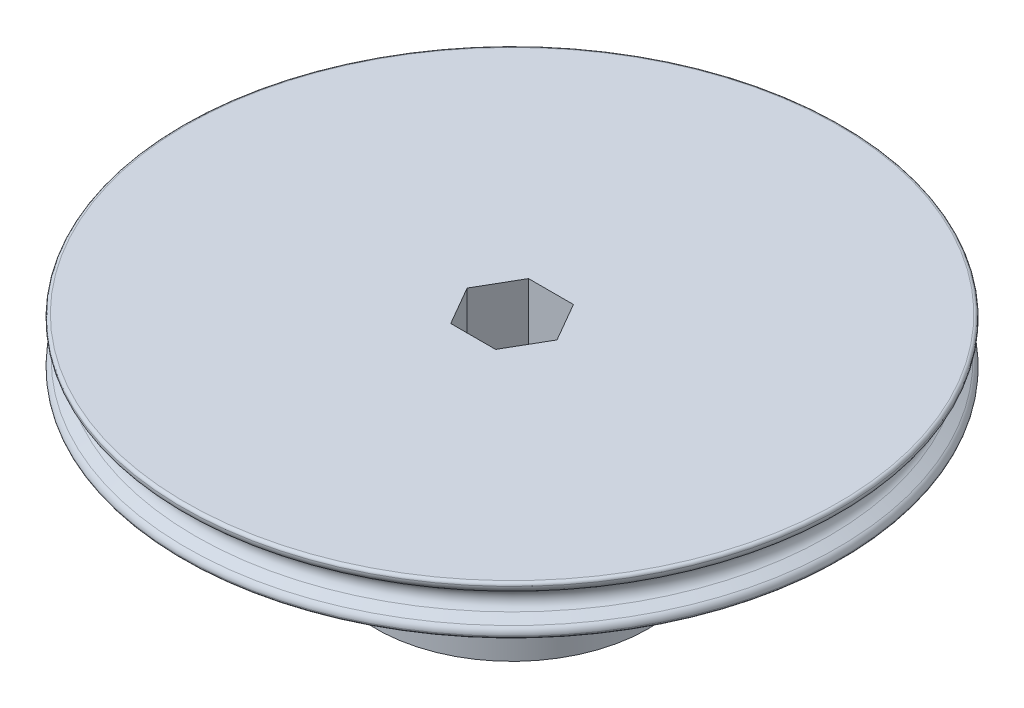
ISO-10303-21;
HEADER;
FILE_DESCRIPTION(('STEP AP214'),'2;1');
FILE_NAME('part.step','',(''),(''),'','','');
FILE_SCHEMA(('AUTOMOTIVE_DESIGN { 1 0 10303 214 1 1 1 1 }'));
ENDSEC;
DATA;
#1=APPLICATION_CONTEXT('core data for automotive mechanical design processes');
#2=APPLICATION_PROTOCOL_DEFINITION('international standard','automotive_design',2000,#1);
#3=PRODUCT_CONTEXT('',#1,'mechanical');
#4=PRODUCT('Part','Part','',(#3));
#5=PRODUCT_RELATED_PRODUCT_CATEGORY('part','',(#4));
#6=PRODUCT_DEFINITION_FORMATION('','',#4);
#7=PRODUCT_DEFINITION_CONTEXT('part definition',#1,'design');
#8=PRODUCT_DEFINITION('design','',#6,#7);
#9=PRODUCT_DEFINITION_SHAPE('','',#8);
#10=(LENGTH_UNIT() NAMED_UNIT(*) SI_UNIT(.MILLI.,.METRE.));
#11=(NAMED_UNIT(*) PLANE_ANGLE_UNIT() SI_UNIT($,.RADIAN.));
#12=(NAMED_UNIT(*) SI_UNIT($,.STERADIAN.) SOLID_ANGLE_UNIT());
#13=UNCERTAINTY_MEASURE_WITH_UNIT(LENGTH_MEASURE(1.E-05),#10,'distance_accuracy_value','');
#14=(GEOMETRIC_REPRESENTATION_CONTEXT(3) GLOBAL_UNCERTAINTY_ASSIGNED_CONTEXT((#13)) GLOBAL_UNIT_ASSIGNED_CONTEXT((#10,
#11,#12)) REPRESENTATION_CONTEXT('',''));
#15=CARTESIAN_POINT('',(0.,0.,0.));
#16=DIRECTION('',(0.,0.,1.));
#17=DIRECTION('',(1.,0.,0.));
#18=AXIS2_PLACEMENT_3D('',#15,#16,#17);
#19=CARTESIAN_POINT('',(0.,-4.00000469999999,0.));
#20=DIRECTION('',(0.,-1.,0.));
#21=DIRECTION('',(1.,0.,0.));
#22=AXIS2_PLACEMENT_3D('',#19,#20,#21);
#23=PLANE('',#22);
#24=CARTESIAN_POINT('',(0.,-4.00000469999999,0.));
#25=DIRECTION('',(0.,1.,0.));
#26=DIRECTION('',(-1.,0.,0.));
#27=AXIS2_PLACEMENT_3D('',#24,#25,#26);
#28=CIRCLE('',#27,53.3006219074877);
#29=CARTESIAN_POINT('',(-53.3006219074877,-4.0000047,0.));
#30=VERTEX_POINT('',#29);
#31=EDGE_CURVE('E149',#30,#30,#28,.T.);
#32=ORIENTED_EDGE('',*,*,#31,.F.);
#33=EDGE_LOOP('',(#32));
#34=FACE_BOUND('',#33,.T.);
#35=CARTESIAN_POINT('',(0.,-4.00000469999999,0.));
#36=DIRECTION('',(0.,-1.,0.));
#37=DIRECTION('',(1.,0.,0.));
#38=AXIS2_PLACEMENT_3D('',#35,#36,#37);
#39=CIRCLE('',#38,22.225);
#40=CARTESIAN_POINT('',(22.225,-4.00000469999999,0.));
#41=VERTEX_POINT('',#40);
#42=EDGE_CURVE('E119',#41,#41,#39,.T.);
#43=ORIENTED_EDGE('',*,*,#42,.F.);
#44=EDGE_LOOP('',(#43));
#45=FACE_BOUND('',#44,.T.);
#46=ADVANCED_FACE('F33',(#34,#45),#23,.T.);
#47=CARTESIAN_POINT('',(0.,3.50000570000001,0.));
#48=DIRECTION('',(0.,1.,0.));
#49=DIRECTION('',(-1.,0.,0.));
#50=AXIS2_PLACEMENT_3D('',#47,#48,#49);
#51=TOROIDAL_SURFACE('',#50,53.3006219074877,0.499999);
#52=CARTESIAN_POINT('',(0.,3.52503594612088,0.));
#53=DIRECTION('',(0.,1.,0.));
#54=DIRECTION('',(-1.,0.,0.));
#55=AXIS2_PLACEMENT_3D('',#52,#53,#54);
#56=CIRCLE('',#55,53.799994);
#57=CARTESIAN_POINT('',(-53.799994,3.52503594612087,0.));
#58=VERTEX_POINT('',#57);
#59=EDGE_CURVE('E11',#58,#58,#56,.T.);
#60=ORIENTED_EDGE('',*,*,#59,.T.);
#61=EDGE_LOOP('',(#60));
#62=FACE_BOUND('',#61,.T.);
#63=CARTESIAN_POINT('',(0.,4.00000470000001,0.));
#64=DIRECTION('',(0.,1.,0.));
#65=DIRECTION('',(-1.,0.,0.));
#66=AXIS2_PLACEMENT_3D('',#63,#64,#65);
#67=CIRCLE('',#66,53.3006219074877);
#68=CARTESIAN_POINT('',(-53.3006219074877,4.0000047,0.));
#69=VERTEX_POINT('',#68);
#70=EDGE_CURVE('E141',#69,#69,#67,.T.);
#71=ORIENTED_EDGE('',*,*,#70,.F.);
#72=EDGE_LOOP('',(#71));
#73=FACE_BOUND('',#72,.T.);
#74=ADVANCED_FACE('F35',(#62,#73),#51,.T.);
#75=CARTESIAN_POINT('',(0.,3.46496335543079,0.));
#76=DIRECTION('',(0.,1.,0.));
#77=DIRECTION('',(-1.,0.,0.));
#78=AXIS2_PLACEMENT_3D('',#75,#76,#77);
#79=TOROIDAL_SURFACE('',#78,52.6015009779704,1.1999976);
#80=CARTESIAN_POINT('',(0.,2.42573494935043,0.));
#81=DIRECTION('',(0.,1.,0.));
#82=DIRECTION('',(-1.,0.,0.));
#83=AXIS2_PLACEMENT_3D('',#80,#81,#82);
#84=CIRCLE('',#83,53.2014997779704);
#85=CARTESIAN_POINT('',(-53.2014997779704,2.42573494935042,0.));
#86=VERTEX_POINT('',#85);
#87=EDGE_CURVE('E41',#86,#86,#84,.T.);
#88=ORIENTED_EDGE('',*,*,#87,.T.);
#89=EDGE_LOOP('',(#88));
#90=FACE_BOUND('',#89,.T.);
#91=ORIENTED_EDGE('',*,*,#59,.F.);
#92=EDGE_LOOP('',(#91));
#93=FACE_BOUND('',#92,.T.);
#94=ADVANCED_FACE('F166',(#90,#93),#79,.T.);
#95=CARTESIAN_POINT('',(0.,2.42573494935043,0.));
#96=DIRECTION('',(0.,1.,0.));
#97=DIRECTION('',(-1.,0.,0.));
#98=AXIS2_PLACEMENT_3D('',#95,#96,#97);
#99=CONICAL_SURFACE('',#98,53.2014997779704,1.0471975511966);
#100=CARTESIAN_POINT('',(0.,1.55884260912055,0.));
#101=DIRECTION('',(0.,1.,0.));
#102=DIRECTION('',(-1.,0.,0.));
#103=AXIS2_PLACEMENT_3D('',#100,#101,#102);
#104=CIRCLE('',#103,51.6999982);
#105=CARTESIAN_POINT('',(-51.6999982,1.55884260912054,0.));
#106=VERTEX_POINT('',#105);
#107=EDGE_CURVE('E161',#106,#106,#104,.T.);
#108=ORIENTED_EDGE('',*,*,#107,.T.);
#109=EDGE_LOOP('',(#108));
#110=FACE_BOUND('',#109,.T.);
#111=ORIENTED_EDGE('',*,*,#87,.F.);
#112=EDGE_LOOP('',(#111));
#113=FACE_BOUND('',#112,.T.);
#114=ADVANCED_FACE('F169',(#110,#113),#99,.T.);
#115=CARTESIAN_POINT('',(0.,0.,0.));
#116=DIRECTION('',(0.,1.,0.));
#117=DIRECTION('',(-1.,0.,0.));
#118=AXIS2_PLACEMENT_3D('',#115,#116,#117);
#119=TOROIDAL_SURFACE('',#118,52.5999964,1.7999964);
#120=CARTESIAN_POINT('',(0.,-1.55884260912053,0.));
#121=DIRECTION('',(0.,1.,0.));
#122=DIRECTION('',(-1.,0.,0.));
#123=AXIS2_PLACEMENT_3D('',#120,#121,#122);
#124=CIRCLE('',#123,51.6999982);
#125=CARTESIAN_POINT('',(-51.6999982,-1.55884260912054,0.));
#126=VERTEX_POINT('',#125);
#127=EDGE_CURVE('E158',#126,#126,#124,.T.);
#128=ORIENTED_EDGE('',*,*,#127,.T.);
#129=EDGE_LOOP('',(#128));
#130=FACE_BOUND('',#129,.T.);
#131=ORIENTED_EDGE('',*,*,#107,.F.);
#132=EDGE_LOOP('',(#131));
#133=FACE_BOUND('',#132,.T.);
#134=ADVANCED_FACE('F171',(#130,#133),#119,.F.);
#135=CARTESIAN_POINT('',(0.,-1.55884260912053,0.));
#136=DIRECTION('',(0.,-1.,0.));
#137=DIRECTION('',(1.,0.,0.));
#138=AXIS2_PLACEMENT_3D('',#135,#136,#137);
#139=CONICAL_SURFACE('',#138,51.6999982,1.0471975511966);
#140=CARTESIAN_POINT('',(0.,-2.42573494935041,0.));
#141=DIRECTION('',(0.,1.,0.));
#142=DIRECTION('',(-1.,0.,0.));
#143=AXIS2_PLACEMENT_3D('',#140,#141,#142);
#144=CIRCLE('',#143,53.2014997779704);
#145=CARTESIAN_POINT('',(-53.2014997779704,-2.42573494935042,0.));
#146=VERTEX_POINT('',#145);
#147=EDGE_CURVE('E155',#146,#146,#144,.T.);
#148=ORIENTED_EDGE('',*,*,#147,.T.);
#149=EDGE_LOOP('',(#148));
#150=FACE_BOUND('',#149,.T.);
#151=ORIENTED_EDGE('',*,*,#127,.F.);
#152=EDGE_LOOP('',(#151));
#153=FACE_BOUND('',#152,.T.);
#154=ADVANCED_FACE('F178',(#150,#153),#139,.T.);
#155=CARTESIAN_POINT('',(0.,-3.46496335543077,0.));
#156=DIRECTION('',(0.,1.,0.));
#157=DIRECTION('',(-1.,0.,0.));
#158=AXIS2_PLACEMENT_3D('',#155,#156,#157);
#159=TOROIDAL_SURFACE('',#158,52.6015009779704,1.1999976);
#160=CARTESIAN_POINT('',(0.,-3.52503594612086,0.));
#161=DIRECTION('',(0.,1.,0.));
#162=DIRECTION('',(-1.,0.,0.));
#163=AXIS2_PLACEMENT_3D('',#160,#161,#162);
#164=CIRCLE('',#163,53.799994);
#165=CARTESIAN_POINT('',(-53.799994,-3.52503594612087,0.));
#166=VERTEX_POINT('',#165);
#167=EDGE_CURVE('E152',#166,#166,#164,.T.);
#168=ORIENTED_EDGE('',*,*,#167,.T.);
#169=EDGE_LOOP('',(#168));
#170=FACE_BOUND('',#169,.T.);
#171=ORIENTED_EDGE('',*,*,#147,.F.);
#172=EDGE_LOOP('',(#171));
#173=FACE_BOUND('',#172,.T.);
#174=ADVANCED_FACE('F199',(#170,#173),#159,.T.);
#175=CARTESIAN_POINT('',(0.,-3.50000569999999,0.));
#176=DIRECTION('',(0.,1.,0.));
#177=DIRECTION('',(-1.,0.,0.));
#178=AXIS2_PLACEMENT_3D('',#175,#176,#177);
#179=TOROIDAL_SURFACE('',#178,53.3006219074877,0.499999);
#180=ORIENTED_EDGE('',*,*,#31,.T.);
#181=EDGE_LOOP('',(#180));
#182=FACE_BOUND('',#181,.T.);
#183=ORIENTED_EDGE('',*,*,#167,.F.);
#184=EDGE_LOOP('',(#183));
#185=FACE_BOUND('',#184,.T.);
#186=ADVANCED_FACE('F196',(#182,#185),#179,.T.);
#187=CARTESIAN_POINT('',(0.,4.00000470000001,0.));
#188=DIRECTION('',(0.,1.,0.));
#189=DIRECTION('',(-1.,0.,0.));
#190=AXIS2_PLACEMENT_3D('',#187,#188,#189);
#191=PLANE('',#190);
#192=DIRECTION('',(0.5,0.,0.866025403784439));
#193=VECTOR('',#192,1.);
#194=CARTESIAN_POINT('',(3.66617420935412,4.00000470000001,-6.35000000000001));
#195=LINE('',#194,#193);
#196=CARTESIAN_POINT('',(3.66617420935412,4.00000470000001,-6.35000000000001));
#197=VERTEX_POINT('',#196);
#198=CARTESIAN_POINT('',(7.33234841870825,4.00000470000002,0.));
#199=VERTEX_POINT('',#198);
#200=EDGE_CURVE('E123',#197,#199,#195,.T.);
#201=ORIENTED_EDGE('',*,*,#200,.T.);
#202=DIRECTION('',(-0.5,0.,0.866025403784439));
#203=VECTOR('',#202,1.);
#204=CARTESIAN_POINT('',(7.33234841870825,4.00000470000002,0.));
#205=LINE('',#204,#203);
#206=CARTESIAN_POINT('',(3.66617420935412,4.00000470000001,6.35));
#207=VERTEX_POINT('',#206);
#208=EDGE_CURVE('E128',#199,#207,#205,.T.);
#209=ORIENTED_EDGE('',*,*,#208,.T.);
#210=DIRECTION('',(-1.,0.,0.));
#211=VECTOR('',#210,1.);
#212=CARTESIAN_POINT('',(3.66617420935412,4.00000470000001,6.35));
#213=LINE('',#212,#211);
#214=CARTESIAN_POINT('',(-3.66617420935412,4.00000470000001,6.35));
#215=VERTEX_POINT('',#214);
#216=EDGE_CURVE('E48',#207,#215,#213,.T.);
#217=ORIENTED_EDGE('',*,*,#216,.T.);
#218=DIRECTION('',(-0.5,0.,-0.866025403784438));
#219=VECTOR('',#218,1.);
#220=CARTESIAN_POINT('',(-3.66617420935412,4.00000470000001,6.35));
#221=LINE('',#220,#219);
#222=CARTESIAN_POINT('',(-7.33234841870825,4.00000470000001,0.));
#223=VERTEX_POINT('',#222);
#224=EDGE_CURVE('E94',#215,#223,#221,.T.);
#225=ORIENTED_EDGE('',*,*,#224,.T.);
#226=DIRECTION('',(0.5,0.,-0.866025403784439));
#227=VECTOR('',#226,1.);
#228=CARTESIAN_POINT('',(-7.33234841870825,4.00000470000001,0.));
#229=LINE('',#228,#227);
#230=CARTESIAN_POINT('',(-3.66617420935413,4.00000470000001,-6.35));
#231=VERTEX_POINT('',#230);
#232=EDGE_CURVE('E133',#223,#231,#229,.T.);
#233=ORIENTED_EDGE('',*,*,#232,.T.);
#234=DIRECTION('',(1.,0.,0.));
#235=VECTOR('',#234,1.);
#236=CARTESIAN_POINT('',(-3.66617420935413,4.00000470000001,-6.35));
#237=LINE('',#236,#235);
#238=EDGE_CURVE('E136',#231,#197,#237,.T.);
#239=ORIENTED_EDGE('',*,*,#238,.T.);
#240=EDGE_LOOP('',(#201,#209,#217,#225,#233,#239));
#241=FACE_BOUND('',#240,.T.);
#242=ORIENTED_EDGE('',*,*,#70,.T.);
#243=EDGE_LOOP('',(#242));
#244=FACE_BOUND('',#243,.T.);
#245=ADVANCED_FACE('F194',(#241,#244),#191,.T.);
#246=CARTESIAN_POINT('',(3.66617420935412,4.00000470000001,-6.35000000000001));
#247=DIRECTION('',(0.866025403784439,0.,-0.5));
#248=DIRECTION('',(-0.5,0.,-0.866025403784439));
#249=AXIS2_PLACEMENT_3D('',#246,#247,#248);
#250=PLANE('',#249);
#251=DIRECTION('',(0.,-1.,0.));
#252=VECTOR('',#251,1.);
#253=CARTESIAN_POINT('',(3.66617420935412,4.00000470000001,-6.35000000000001));
#254=LINE('',#253,#252);
#255=CARTESIAN_POINT('',(3.66617420935417,-29.4000047,-6.34999999999998));
#256=VERTEX_POINT('',#255);
#257=EDGE_CURVE('E56',#197,#256,#254,.T.);
#258=ORIENTED_EDGE('',*,*,#257,.T.);
#259=DIRECTION('',(0.499999999999993,0.,0.866025403784442));
#260=VECTOR('',#259,1.);
#261=CARTESIAN_POINT('',(3.66617420935417,-29.4000047,-6.34999999999998));
#262=LINE('',#261,#260);
#263=CARTESIAN_POINT('',(7.33234841870826,-29.4000047,0.));
#264=VERTEX_POINT('',#263);
#265=EDGE_CURVE('E114',#256,#264,#262,.T.);
#266=ORIENTED_EDGE('',*,*,#265,.T.);
#267=DIRECTION('',(0.,-1.,0.));
#268=VECTOR('',#267,1.);
#269=CARTESIAN_POINT('',(7.33234841870825,4.00000470000002,0.));
#270=LINE('',#269,#268);
#271=EDGE_CURVE('E139',#199,#264,#270,.T.);
#272=ORIENTED_EDGE('',*,*,#271,.F.);
#273=ORIENTED_EDGE('',*,*,#200,.F.);
#274=EDGE_LOOP('',(#258,#266,#272,#273));
#275=FACE_BOUND('',#274,.T.);
#276=ADVANCED_FACE('F229',(#275),#250,.F.);
#277=CARTESIAN_POINT('',(-3.66617420935413,4.00000470000001,-6.35));
#278=DIRECTION('',(0.,0.,-1.));
#279=DIRECTION('',(-1.,0.,0.));
#280=AXIS2_PLACEMENT_3D('',#277,#278,#279);
#281=PLANE('',#280);
#282=DIRECTION('',(0.,-1.,0.));
#283=VECTOR('',#282,1.);
#284=CARTESIAN_POINT('',(-3.66617420935413,4.00000470000001,-6.35));
#285=LINE('',#284,#283);
#286=CARTESIAN_POINT('',(-3.66617420935409,-29.4000047,-6.35000000000002));
#287=VERTEX_POINT('',#286);
#288=EDGE_CURVE('E142',#231,#287,#285,.T.);
#289=ORIENTED_EDGE('',*,*,#288,.T.);
#290=DIRECTION('',(1.,0.,0.));
#291=VECTOR('',#290,1.);
#292=CARTESIAN_POINT('',(-3.66617420935409,-29.4000047,-6.35000000000002));
#293=LINE('',#292,#291);
#294=EDGE_CURVE('E110',#287,#256,#293,.T.);
#295=ORIENTED_EDGE('',*,*,#294,.T.);
#296=ORIENTED_EDGE('',*,*,#257,.F.);
#297=ORIENTED_EDGE('',*,*,#238,.F.);
#298=EDGE_LOOP('',(#289,#295,#296,#297));
#299=FACE_BOUND('',#298,.T.);
#300=ADVANCED_FACE('F241',(#299),#281,.F.);
#301=CARTESIAN_POINT('',(-7.33234841870825,4.00000470000001,0.));
#302=DIRECTION('',(-0.866025403784439,0.,-0.5));
#303=DIRECTION('',(-0.5,0.,0.866025403784439));
#304=AXIS2_PLACEMENT_3D('',#301,#302,#303);
#305=PLANE('',#304);
#306=DIRECTION('',(0.,-1.,0.));
#307=VECTOR('',#306,1.);
#308=CARTESIAN_POINT('',(-7.33234841870825,4.00000470000001,0.));
#309=LINE('',#308,#307);
#310=CARTESIAN_POINT('',(-7.33234841870824,-29.4000047,0.));
#311=VERTEX_POINT('',#310);
#312=EDGE_CURVE('E95',#223,#311,#309,.T.);
#313=ORIENTED_EDGE('',*,*,#312,.T.);
#314=DIRECTION('',(0.500000000000003,0.,-0.866025403784437));
#315=VECTOR('',#314,1.);
#316=CARTESIAN_POINT('',(-7.33234841870824,-29.4000047,0.));
#317=LINE('',#316,#315);
#318=EDGE_CURVE('E108',#311,#287,#317,.T.);
#319=ORIENTED_EDGE('',*,*,#318,.T.);
#320=ORIENTED_EDGE('',*,*,#288,.F.);
#321=ORIENTED_EDGE('',*,*,#232,.F.);
#322=EDGE_LOOP('',(#313,#319,#320,#321));
#323=FACE_BOUND('',#322,.T.);
#324=ADVANCED_FACE('F247',(#323),#305,.F.);
#325=CARTESIAN_POINT('',(-3.66617420935412,4.00000470000001,6.35));
#326=DIRECTION('',(-0.866025403784438,0.,0.5));
#327=DIRECTION('',(0.5,0.,0.866025403784439));
#328=AXIS2_PLACEMENT_3D('',#325,#326,#327);
#329=PLANE('',#328);
#330=DIRECTION('',(0.,-1.,0.));
#331=VECTOR('',#330,1.);
#332=CARTESIAN_POINT('',(-3.66617420935412,4.00000470000001,6.35));
#333=LINE('',#332,#331);
#334=CARTESIAN_POINT('',(-3.66617420935412,-29.4000047,6.35));
#335=VERTEX_POINT('',#334);
#336=EDGE_CURVE('E87',#215,#335,#333,.T.);
#337=ORIENTED_EDGE('',*,*,#336,.T.);
#338=DIRECTION('',(-0.499999999999999,0.,-0.866025403784439));
#339=VECTOR('',#338,1.);
#340=CARTESIAN_POINT('',(-3.66617420935412,-29.4000047,6.35));
#341=LINE('',#340,#339);
#342=EDGE_CURVE('E91',#335,#311,#341,.T.);
#343=ORIENTED_EDGE('',*,*,#342,.T.);
#344=ORIENTED_EDGE('',*,*,#312,.F.);
#345=ORIENTED_EDGE('',*,*,#224,.F.);
#346=EDGE_LOOP('',(#337,#343,#344,#345));
#347=FACE_BOUND('',#346,.T.);
#348=ADVANCED_FACE('F89',(#347),#329,.F.);
#349=CARTESIAN_POINT('',(3.66617420935412,4.00000470000001,6.35));
#350=DIRECTION('',(0.,0.,1.));
#351=DIRECTION('',(1.,0.,0.));
#352=AXIS2_PLACEMENT_3D('',#349,#350,#351);
#353=PLANE('',#352);
#354=DIRECTION('',(0.,-1.,0.));
#355=VECTOR('',#354,1.);
#356=CARTESIAN_POINT('',(3.66617420935412,4.00000470000001,6.35));
#357=LINE('',#356,#355);
#358=CARTESIAN_POINT('',(3.66617420935406,-29.4000047,6.35000000000004));
#359=VERTEX_POINT('',#358);
#360=EDGE_CURVE('E96',#207,#359,#357,.T.);
#361=ORIENTED_EDGE('',*,*,#360,.T.);
#362=DIRECTION('',(-1.,0.,0.));
#363=VECTOR('',#362,1.);
#364=CARTESIAN_POINT('',(3.66617420935406,-29.4000047,6.35000000000004));
#365=LINE('',#364,#363);
#366=EDGE_CURVE('E99',#359,#335,#365,.T.);
#367=ORIENTED_EDGE('',*,*,#366,.T.);
#368=ORIENTED_EDGE('',*,*,#336,.F.);
#369=ORIENTED_EDGE('',*,*,#216,.F.);
#370=EDGE_LOOP('',(#361,#367,#368,#369));
#371=FACE_BOUND('',#370,.T.);
#372=ADVANCED_FACE('F100',(#371),#353,.F.);
#373=CARTESIAN_POINT('',(7.33234841870825,4.00000470000002,0.));
#374=DIRECTION('',(0.866025403784439,0.,0.5));
#375=DIRECTION('',(0.5,0.,-0.866025403784439));
#376=AXIS2_PLACEMENT_3D('',#373,#374,#375);
#377=PLANE('',#376);
#378=ORIENTED_EDGE('',*,*,#271,.T.);
#379=DIRECTION('',(-0.500000000000009,0.,0.866025403784433));
#380=VECTOR('',#379,1.);
#381=CARTESIAN_POINT('',(7.33234841870825,-29.4000047,0.));
#382=LINE('',#381,#380);
#383=EDGE_CURVE('E117',#264,#359,#382,.T.);
#384=ORIENTED_EDGE('',*,*,#383,.T.);
#385=ORIENTED_EDGE('',*,*,#360,.F.);
#386=ORIENTED_EDGE('',*,*,#208,.F.);
#387=EDGE_LOOP('',(#378,#384,#385,#386));
#388=FACE_BOUND('',#387,.T.);
#389=ADVANCED_FACE('F267',(#388),#377,.F.);
#390=CARTESIAN_POINT('',(0.,-29.4000047,0.));
#391=DIRECTION('',(0.,-1.,0.));
#392=DIRECTION('',(1.,0.,0.));
#393=AXIS2_PLACEMENT_3D('',#390,#391,#392);
#394=PLANE('',#393);
#395=CARTESIAN_POINT('',(0.,-29.4000047,0.));
#396=DIRECTION('',(0.,-1.,0.));
#397=DIRECTION('',(1.,0.,0.));
#398=AXIS2_PLACEMENT_3D('',#395,#396,#397);
#399=CIRCLE('',#398,22.225);
#400=CARTESIAN_POINT('',(22.225,-29.4000047,0.));
#401=VERTEX_POINT('',#400);
#402=EDGE_CURVE('E120',#401,#401,#399,.T.);
#403=ORIENTED_EDGE('',*,*,#402,.T.);
#404=EDGE_LOOP('',(#403));
#405=FACE_BOUND('',#404,.T.);
#406=ORIENTED_EDGE('',*,*,#342,.F.);
#407=ORIENTED_EDGE('',*,*,#366,.F.);
#408=ORIENTED_EDGE('',*,*,#383,.F.);
#409=ORIENTED_EDGE('',*,*,#265,.F.);
#410=ORIENTED_EDGE('',*,*,#294,.F.);
#411=ORIENTED_EDGE('',*,*,#318,.F.);
#412=EDGE_LOOP('',(#406,#407,#408,#409,#410,#411));
#413=FACE_BOUND('',#412,.T.);
#414=ADVANCED_FACE('F105',(#405,#413),#394,.T.);
#415=CARTESIAN_POINT('',(0.,-29.4000047,0.));
#416=DIRECTION('',(0.,1.,0.));
#417=DIRECTION('',(-1.,0.,0.));
#418=AXIS2_PLACEMENT_3D('',#415,#416,#417);
#419=CYLINDRICAL_SURFACE('',#418,22.225);
#420=ORIENTED_EDGE('',*,*,#402,.F.);
#421=EDGE_LOOP('',(#420));
#422=FACE_BOUND('',#421,.T.);
#423=ORIENTED_EDGE('',*,*,#42,.T.);
#424=EDGE_LOOP('',(#423));
#425=FACE_BOUND('',#424,.T.);
#426=ADVANCED_FACE('F281',(#422,#425),#419,.T.);
#427=CLOSED_SHELL('',(#46,#74,#94,#114,#134,#154,#174,#186,#245,#276,#300,#324,#348,#372,#389,
#414,#426));
#428=MANIFOLD_SOLID_BREP('B2',#427);
#429=ADVANCED_BREP_SHAPE_REPRESENTATION('',(#18,#428),#14);
#430=SHAPE_DEFINITION_REPRESENTATION(#9,#429);
ENDSEC;
END-ISO-10303-21;
